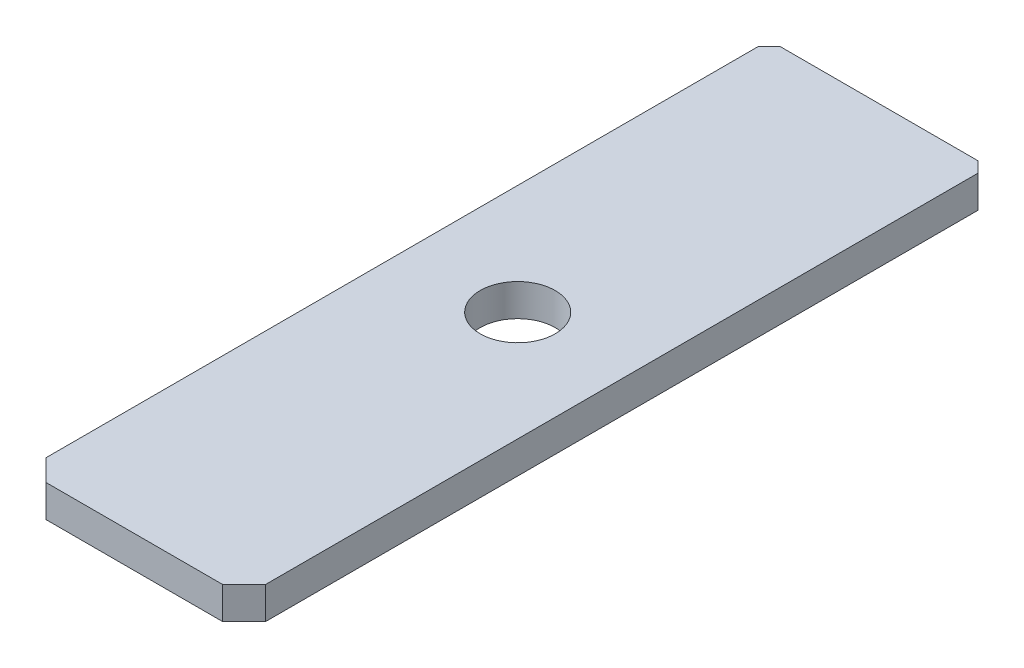
ISO-10303-21;
HEADER;
FILE_DESCRIPTION(('STEP AP214'),'2;1');
FILE_NAME('part.step','',(''),(''),'','','');
FILE_SCHEMA(('AUTOMOTIVE_DESIGN { 1 0 10303 214 1 1 1 1 }'));
ENDSEC;
DATA;
#1=APPLICATION_CONTEXT('core data for automotive mechanical design processes');
#2=APPLICATION_PROTOCOL_DEFINITION('international standard','automotive_design',2000,#1);
#3=PRODUCT_CONTEXT('',#1,'mechanical');
#4=PRODUCT('Part','Part','',(#3));
#5=PRODUCT_RELATED_PRODUCT_CATEGORY('part','',(#4));
#6=PRODUCT_DEFINITION_FORMATION('','',#4);
#7=PRODUCT_DEFINITION_CONTEXT('part definition',#1,'design');
#8=PRODUCT_DEFINITION('design','',#6,#7);
#9=PRODUCT_DEFINITION_SHAPE('','',#8);
#10=(LENGTH_UNIT() NAMED_UNIT(*) SI_UNIT(.MILLI.,.METRE.));
#11=(NAMED_UNIT(*) PLANE_ANGLE_UNIT() SI_UNIT($,.RADIAN.));
#12=(NAMED_UNIT(*) SI_UNIT($,.STERADIAN.) SOLID_ANGLE_UNIT());
#13=UNCERTAINTY_MEASURE_WITH_UNIT(LENGTH_MEASURE(1.E-05),#10,'distance_accuracy_value','');
#14=(GEOMETRIC_REPRESENTATION_CONTEXT(3) GLOBAL_UNCERTAINTY_ASSIGNED_CONTEXT((#13)) GLOBAL_UNIT_ASSIGNED_CONTEXT((#10,
#11,#12)) REPRESENTATION_CONTEXT('',''));
#15=CARTESIAN_POINT('',(0.,0.,0.));
#16=DIRECTION('',(0.,0.,1.));
#17=DIRECTION('',(1.,0.,0.));
#18=AXIS2_PLACEMENT_3D('',#15,#16,#17);
#19=CARTESIAN_POINT('',(5.12,1.5,-17.365));
#20=DIRECTION('',(-1.,0.,0.));
#21=DIRECTION('',(0.,0.,1.));
#22=AXIS2_PLACEMENT_3D('',#19,#20,#21);
#23=PLANE('',#22);
#24=DIRECTION('',(0.,0.,-1.));
#25=VECTOR('',#24,1.);
#26=CARTESIAN_POINT('',(5.12,1.5,-17.365));
#27=LINE('',#26,#25);
#28=CARTESIAN_POINT('',(5.12,1.5,16.365));
#29=VERTEX_POINT('',#28);
#30=CARTESIAN_POINT('',(5.11999999999999,1.5,-16.865));
#31=VERTEX_POINT('',#30);
#32=EDGE_CURVE('E126',#29,#31,#27,.T.);
#33=ORIENTED_EDGE('',*,*,#32,.F.);
#34=DIRECTION('',(0.,-1.,0.));
#35=VECTOR('',#34,1.);
#36=CARTESIAN_POINT('',(5.12,1.5,16.365));
#37=LINE('',#36,#35);
#38=CARTESIAN_POINT('',(5.12000000000001,0.,16.365));
#39=VERTEX_POINT('',#38);
#40=EDGE_CURVE('E11',#29,#39,#37,.T.);
#41=ORIENTED_EDGE('',*,*,#40,.T.);
#42=DIRECTION('',(0.,0.,-1.));
#43=VECTOR('',#42,1.);
#44=CARTESIAN_POINT('',(5.12,0.,-17.365));
#45=LINE('',#44,#43);
#46=CARTESIAN_POINT('',(5.12,0.,-16.865));
#47=VERTEX_POINT('',#46);
#48=EDGE_CURVE('E128',#39,#47,#45,.T.);
#49=ORIENTED_EDGE('',*,*,#48,.T.);
#50=DIRECTION('',(0.,1.,0.));
#51=VECTOR('',#50,1.);
#52=CARTESIAN_POINT('',(5.12,1.5,-16.865));
#53=LINE('',#52,#51);
#54=EDGE_CURVE('E141',#47,#31,#53,.T.);
#55=ORIENTED_EDGE('',*,*,#54,.T.);
#56=EDGE_LOOP('',(#33,#41,#49,#55));
#57=FACE_BOUND('',#56,.T.);
#58=ADVANCED_FACE('F33',(#57),#23,.F.);
#59=CARTESIAN_POINT('',(-5.12,1.5,-17.365));
#60=DIRECTION('',(0.,0.,1.));
#61=DIRECTION('',(1.,0.,0.));
#62=AXIS2_PLACEMENT_3D('',#59,#60,#61);
#63=PLANE('',#62);
#64=DIRECTION('',(-1.,0.,0.));
#65=VECTOR('',#64,1.);
#66=CARTESIAN_POINT('',(-5.12,0.,-17.365));
#67=LINE('',#66,#65);
#68=CARTESIAN_POINT('',(4.62,0.,-17.365));
#69=VERTEX_POINT('',#68);
#70=CARTESIAN_POINT('',(-4.62,0.,-17.365));
#71=VERTEX_POINT('',#70);
#72=EDGE_CURVE('E123',#69,#71,#67,.T.);
#73=ORIENTED_EDGE('',*,*,#72,.T.);
#74=DIRECTION('',(0.,1.,0.));
#75=VECTOR('',#74,1.);
#76=CARTESIAN_POINT('',(-4.62,1.5,-17.365));
#77=LINE('',#76,#75);
#78=CARTESIAN_POINT('',(-4.62,1.5,-17.365));
#79=VERTEX_POINT('',#78);
#80=EDGE_CURVE('E106',#71,#79,#77,.T.);
#81=ORIENTED_EDGE('',*,*,#80,.T.);
#82=DIRECTION('',(-1.,0.,0.));
#83=VECTOR('',#82,1.);
#84=CARTESIAN_POINT('',(-5.12,1.5,-17.365));
#85=LINE('',#84,#83);
#86=CARTESIAN_POINT('',(4.61999999999999,1.5,-17.365));
#87=VERTEX_POINT('',#86);
#88=EDGE_CURVE('E270',#87,#79,#85,.T.);
#89=ORIENTED_EDGE('',*,*,#88,.F.);
#90=DIRECTION('',(0.,-1.,0.));
#91=VECTOR('',#90,1.);
#92=CARTESIAN_POINT('',(4.62,1.5,-17.365));
#93=LINE('',#92,#91);
#94=EDGE_CURVE('E111',#87,#69,#93,.T.);
#95=ORIENTED_EDGE('',*,*,#94,.T.);
#96=EDGE_LOOP('',(#73,#81,#89,#95));
#97=FACE_BOUND('',#96,.T.);
#98=ADVANCED_FACE('F174',(#97),#63,.F.);
#99=CARTESIAN_POINT('',(-5.12,1.5,-17.365));
#100=DIRECTION('',(1.,0.,0.));
#101=DIRECTION('',(0.,0.,-1.));
#102=AXIS2_PLACEMENT_3D('',#99,#100,#101);
#103=PLANE('',#102);
#104=DIRECTION('',(0.,0.,1.));
#105=VECTOR('',#104,1.);
#106=CARTESIAN_POINT('',(-5.12,0.,-17.365));
#107=LINE('',#106,#105);
#108=CARTESIAN_POINT('',(-5.12,0.,-16.865));
#109=VERTEX_POINT('',#108);
#110=CARTESIAN_POINT('',(-5.12,0.,16.365));
#111=VERTEX_POINT('',#110);
#112=EDGE_CURVE('E115',#109,#111,#107,.T.);
#113=ORIENTED_EDGE('',*,*,#112,.T.);
#114=DIRECTION('',(0.,1.,0.));
#115=VECTOR('',#114,1.);
#116=CARTESIAN_POINT('',(-5.12,1.5,16.365));
#117=LINE('',#116,#115);
#118=CARTESIAN_POINT('',(-5.12,1.5,16.365));
#119=VERTEX_POINT('',#118);
#120=EDGE_CURVE('E56',#111,#119,#117,.T.);
#121=ORIENTED_EDGE('',*,*,#120,.T.);
#122=DIRECTION('',(0.,0.,1.));
#123=VECTOR('',#122,1.);
#124=CARTESIAN_POINT('',(-5.12,1.5,-17.365));
#125=LINE('',#124,#123);
#126=CARTESIAN_POINT('',(-5.12,1.5,-16.865));
#127=VERTEX_POINT('',#126);
#128=EDGE_CURVE('E116',#127,#119,#125,.T.);
#129=ORIENTED_EDGE('',*,*,#128,.F.);
#130=DIRECTION('',(0.,-1.,0.));
#131=VECTOR('',#130,1.);
#132=CARTESIAN_POINT('',(-5.12,1.5,-16.865));
#133=LINE('',#132,#131);
#134=EDGE_CURVE('E105',#127,#109,#133,.T.);
#135=ORIENTED_EDGE('',*,*,#134,.T.);
#136=EDGE_LOOP('',(#113,#121,#129,#135));
#137=FACE_BOUND('',#136,.T.);
#138=ADVANCED_FACE('F114',(#137),#103,.F.);
#139=CARTESIAN_POINT('',(-5.12,1.5,17.365));
#140=DIRECTION('',(0.,0.,-1.));
#141=DIRECTION('',(-1.,0.,0.));
#142=AXIS2_PLACEMENT_3D('',#139,#140,#141);
#143=PLANE('',#142);
#144=DIRECTION('',(1.,0.,0.));
#145=VECTOR('',#144,1.);
#146=CARTESIAN_POINT('',(-5.12,1.5,17.365));
#147=LINE('',#146,#145);
#148=CARTESIAN_POINT('',(-4.12,1.5,17.365));
#149=VERTEX_POINT('',#148);
#150=CARTESIAN_POINT('',(4.11999999999999,1.5,17.365));
#151=VERTEX_POINT('',#150);
#152=EDGE_CURVE('E117',#149,#151,#147,.T.);
#153=ORIENTED_EDGE('',*,*,#152,.F.);
#154=DIRECTION('',(0.,-1.,0.));
#155=VECTOR('',#154,1.);
#156=CARTESIAN_POINT('',(-4.12,1.5,17.365));
#157=LINE('',#156,#155);
#158=CARTESIAN_POINT('',(-4.12,0.,17.365));
#159=VERTEX_POINT('',#158);
#160=EDGE_CURVE('E146',#149,#159,#157,.T.);
#161=ORIENTED_EDGE('',*,*,#160,.T.);
#162=DIRECTION('',(1.,0.,0.));
#163=VECTOR('',#162,1.);
#164=CARTESIAN_POINT('',(-5.12,0.,17.365));
#165=LINE('',#164,#163);
#166=CARTESIAN_POINT('',(4.11999999999999,0.,17.365));
#167=VERTEX_POINT('',#166);
#168=EDGE_CURVE('E122',#159,#167,#165,.T.);
#169=ORIENTED_EDGE('',*,*,#168,.T.);
#170=DIRECTION('',(0.,1.,0.));
#171=VECTOR('',#170,1.);
#172=CARTESIAN_POINT('',(4.11999999999999,1.5,17.365));
#173=LINE('',#172,#171);
#174=EDGE_CURVE('E144',#167,#151,#173,.T.);
#175=ORIENTED_EDGE('',*,*,#174,.T.);
#176=EDGE_LOOP('',(#153,#161,#169,#175));
#177=FACE_BOUND('',#176,.T.);
#178=ADVANCED_FACE('F159',(#177),#143,.F.);
#179=CARTESIAN_POINT('',(5.12,1.5,17.365));
#180=DIRECTION('',(0.,1.,0.));
#181=DIRECTION('',(0.,0.,1.));
#182=AXIS2_PLACEMENT_3D('',#179,#180,#181);
#183=PLANE('',#182);
#184=CARTESIAN_POINT('',(0.,1.5,-0.515000000000002));
#185=DIRECTION('',(0.,1.,0.));
#186=DIRECTION('',(0.,0.,1.));
#187=AXIS2_PLACEMENT_3D('',#184,#185,#186);
#188=CIRCLE('',#187,1.75);
#189=CARTESIAN_POINT('',(0.,1.5,1.235));
#190=VERTEX_POINT('',#189);
#191=EDGE_CURVE('E265',#190,#190,#188,.T.);
#192=ORIENTED_EDGE('',*,*,#191,.F.);
#193=EDGE_LOOP('',(#192));
#194=FACE_BOUND('',#193,.T.);
#195=ORIENTED_EDGE('',*,*,#128,.T.);
#196=DIRECTION('',(-0.707106781186546,0.,-0.707106781186549));
#197=VECTOR('',#196,1.);
#198=CARTESIAN_POINT('',(0.499999999999984,1.5,21.985));
#199=LINE('',#198,#197);
#200=EDGE_CURVE('E41',#119,#149,#199,.F.);
#201=ORIENTED_EDGE('',*,*,#200,.T.);
#202=ORIENTED_EDGE('',*,*,#152,.T.);
#203=DIRECTION('',(-0.70710678118655,0.,0.707106781186545));
#204=VECTOR('',#203,1.);
#205=CARTESIAN_POINT('',(4.62,1.5,16.865));
#206=LINE('',#205,#204);
#207=EDGE_CURVE('E48',#151,#29,#206,.F.);
#208=ORIENTED_EDGE('',*,*,#207,.T.);
#209=ORIENTED_EDGE('',*,*,#32,.T.);
#210=DIRECTION('',(0.707106781186545,0.,0.70710678118655));
#211=VECTOR('',#210,1.);
#212=CARTESIAN_POINT('',(22.235,1.5,0.250000000000122));
#213=LINE('',#212,#211);
#214=EDGE_CURVE('E137',#31,#87,#213,.F.);
#215=ORIENTED_EDGE('',*,*,#214,.T.);
#216=ORIENTED_EDGE('',*,*,#88,.T.);
#217=DIRECTION('',(0.70710678118655,0.,-0.707106781186545));
#218=VECTOR('',#217,1.);
#219=CARTESIAN_POINT('',(-17.115,1.5,-4.87000000000012));
#220=LINE('',#219,#218);
#221=EDGE_CURVE('E139',#79,#127,#220,.F.);
#222=ORIENTED_EDGE('',*,*,#221,.T.);
#223=EDGE_LOOP('',(#195,#201,#202,#208,#209,#215,#216,#222));
#224=FACE_BOUND('',#223,.T.);
#225=ADVANCED_FACE('F155',(#194,#224),#183,.T.);
#226=CARTESIAN_POINT('',(5.12,0.,17.365));
#227=DIRECTION('',(0.,1.,0.));
#228=DIRECTION('',(0.,0.,1.));
#229=AXIS2_PLACEMENT_3D('',#226,#227,#228);
#230=PLANE('',#229);
#231=CARTESIAN_POINT('',(0.,0.,-0.515000000000002));
#232=DIRECTION('',(0.,1.,0.));
#233=DIRECTION('',(0.,0.,1.));
#234=AXIS2_PLACEMENT_3D('',#231,#232,#233);
#235=CIRCLE('',#234,1.75);
#236=CARTESIAN_POINT('',(0.,0.,1.235));
#237=VERTEX_POINT('',#236);
#238=EDGE_CURVE('E262',#237,#237,#235,.T.);
#239=ORIENTED_EDGE('',*,*,#238,.T.);
#240=EDGE_LOOP('',(#239));
#241=FACE_BOUND('',#240,.T.);
#242=ORIENTED_EDGE('',*,*,#168,.F.);
#243=DIRECTION('',(0.707106781186546,0.,0.707106781186549));
#244=VECTOR('',#243,1.);
#245=CARTESIAN_POINT('',(-4.12,0.,17.365));
#246=LINE('',#245,#244);
#247=EDGE_CURVE('E121',#159,#111,#246,.F.);
#248=ORIENTED_EDGE('',*,*,#247,.T.);
#249=ORIENTED_EDGE('',*,*,#112,.F.);
#250=DIRECTION('',(-0.70710678118655,0.,0.707106781186545));
#251=VECTOR('',#250,1.);
#252=CARTESIAN_POINT('',(-5.12,0.,-16.865));
#253=LINE('',#252,#251);
#254=EDGE_CURVE('E101',#109,#71,#253,.F.);
#255=ORIENTED_EDGE('',*,*,#254,.T.);
#256=ORIENTED_EDGE('',*,*,#72,.F.);
#257=DIRECTION('',(-0.707106781186545,0.,-0.70710678118655));
#258=VECTOR('',#257,1.);
#259=CARTESIAN_POINT('',(4.62,0.,-17.365));
#260=LINE('',#259,#258);
#261=EDGE_CURVE('E112',#69,#47,#260,.F.);
#262=ORIENTED_EDGE('',*,*,#261,.T.);
#263=ORIENTED_EDGE('',*,*,#48,.F.);
#264=DIRECTION('',(0.70710678118655,0.,-0.707106781186545));
#265=VECTOR('',#264,1.);
#266=CARTESIAN_POINT('',(5.12,0.,16.365));
#267=LINE('',#266,#265);
#268=EDGE_CURVE('E149',#39,#167,#267,.F.);
#269=ORIENTED_EDGE('',*,*,#268,.T.);
#270=EDGE_LOOP('',(#242,#248,#249,#255,#256,#262,#263,#269));
#271=FACE_BOUND('',#270,.T.);
#272=ADVANCED_FACE('F120',(#241,#271),#230,.F.);
#273=CARTESIAN_POINT('',(-5.12,1.5,-16.865));
#274=DIRECTION('',(0.707106781186545,0.,0.70710678118655));
#275=DIRECTION('',(0.70710678118655,0.,-0.707106781186545));
#276=AXIS2_PLACEMENT_3D('',#273,#274,#275);
#277=PLANE('',#276);
#278=ORIENTED_EDGE('',*,*,#221,.F.);
#279=ORIENTED_EDGE('',*,*,#80,.F.);
#280=ORIENTED_EDGE('',*,*,#254,.F.);
#281=ORIENTED_EDGE('',*,*,#134,.F.);
#282=EDGE_LOOP('',(#278,#279,#280,#281));
#283=FACE_BOUND('',#282,.T.);
#284=ADVANCED_FACE('F104',(#283),#277,.F.);
#285=CARTESIAN_POINT('',(4.62,1.5,-17.365));
#286=DIRECTION('',(-0.70710678118655,0.,0.707106781186545));
#287=DIRECTION('',(0.707106781186545,0.,0.70710678118655));
#288=AXIS2_PLACEMENT_3D('',#285,#286,#287);
#289=PLANE('',#288);
#290=ORIENTED_EDGE('',*,*,#214,.F.);
#291=ORIENTED_EDGE('',*,*,#54,.F.);
#292=ORIENTED_EDGE('',*,*,#261,.F.);
#293=ORIENTED_EDGE('',*,*,#94,.F.);
#294=EDGE_LOOP('',(#290,#291,#292,#293));
#295=FACE_BOUND('',#294,.T.);
#296=ADVANCED_FACE('F164',(#295),#289,.F.);
#297=CARTESIAN_POINT('',(-4.12,1.5,17.365));
#298=DIRECTION('',(0.707106781186549,0.,-0.707106781186546));
#299=DIRECTION('',(-0.707106781186546,0.,-0.707106781186549));
#300=AXIS2_PLACEMENT_3D('',#297,#298,#299);
#301=PLANE('',#300);
#302=ORIENTED_EDGE('',*,*,#200,.F.);
#303=ORIENTED_EDGE('',*,*,#120,.F.);
#304=ORIENTED_EDGE('',*,*,#247,.F.);
#305=ORIENTED_EDGE('',*,*,#160,.F.);
#306=EDGE_LOOP('',(#302,#303,#304,#305));
#307=FACE_BOUND('',#306,.T.);
#308=ADVANCED_FACE('F162',(#307),#301,.F.);
#309=CARTESIAN_POINT('',(5.12,1.5,16.365));
#310=DIRECTION('',(-0.707106781186545,0.,-0.70710678118655));
#311=DIRECTION('',(-0.70710678118655,0.,0.707106781186545));
#312=AXIS2_PLACEMENT_3D('',#309,#310,#311);
#313=PLANE('',#312);
#314=ORIENTED_EDGE('',*,*,#207,.F.);
#315=ORIENTED_EDGE('',*,*,#174,.F.);
#316=ORIENTED_EDGE('',*,*,#268,.F.);
#317=ORIENTED_EDGE('',*,*,#40,.F.);
#318=EDGE_LOOP('',(#314,#315,#316,#317));
#319=FACE_BOUND('',#318,.T.);
#320=ADVANCED_FACE('F35',(#319),#313,.F.);
#321=CARTESIAN_POINT('',(0.,0.,-0.515000000000002));
#322=DIRECTION('',(0.,1.,0.));
#323=DIRECTION('',(0.,0.,1.));
#324=AXIS2_PLACEMENT_3D('',#321,#322,#323);
#325=CYLINDRICAL_SURFACE('',#324,1.75);
#326=ORIENTED_EDGE('',*,*,#238,.F.);
#327=EDGE_LOOP('',(#326));
#328=FACE_BOUND('',#327,.T.);
#329=ORIENTED_EDGE('',*,*,#191,.T.);
#330=EDGE_LOOP('',(#329));
#331=FACE_BOUND('',#330,.T.);
#332=ADVANCED_FACE('F169',(#328,#331),#325,.F.);
#333=CLOSED_SHELL('',(#58,#98,#138,#178,#225,#272,#284,#296,#308,#320,#332));
#334=MANIFOLD_SOLID_BREP('B2',#333);
#335=ADVANCED_BREP_SHAPE_REPRESENTATION('',(#18,#334),#14);
#336=SHAPE_DEFINITION_REPRESENTATION(#9,#335);
ENDSEC;
END-ISO-10303-21;
